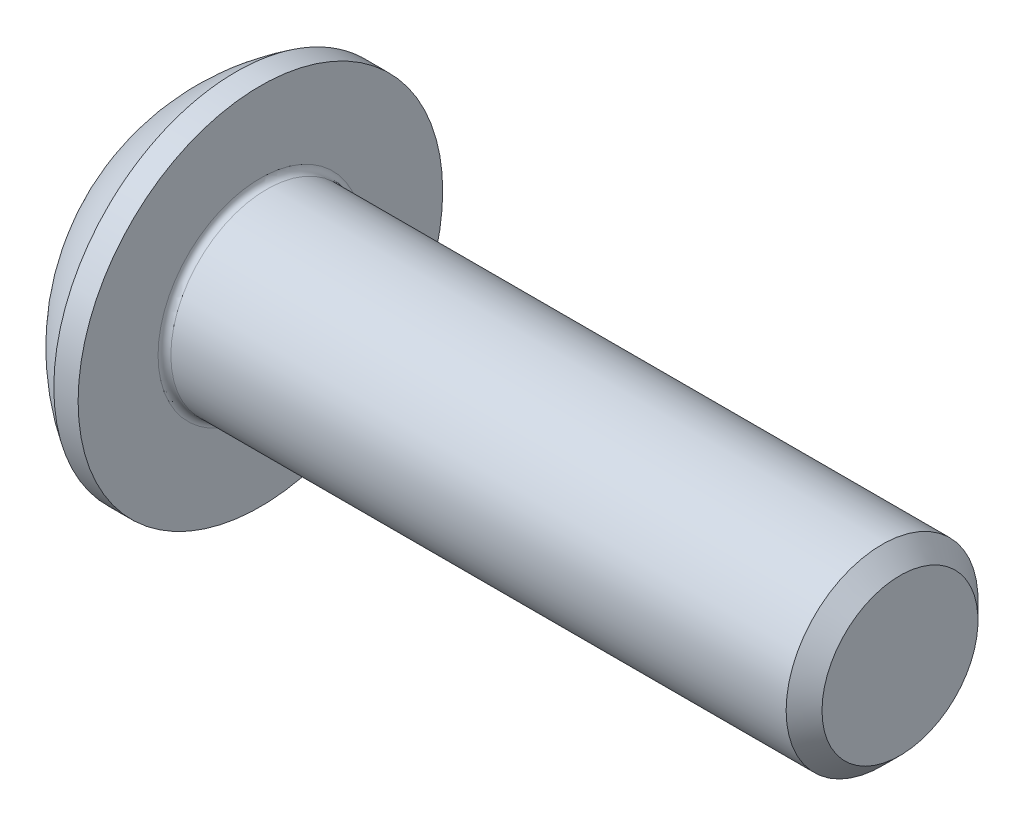
ISO-10303-21;
HEADER;
FILE_DESCRIPTION(('STEP AP214'),'2;1');
FILE_NAME('part.step','',(''),(''),'','','');
FILE_SCHEMA(('AUTOMOTIVE_DESIGN { 1 0 10303 214 1 1 1 1 }'));
ENDSEC;
DATA;
#1=APPLICATION_CONTEXT('core data for automotive mechanical design processes');
#2=APPLICATION_PROTOCOL_DEFINITION('international standard','automotive_design',2000,#1);
#3=PRODUCT_CONTEXT('',#1,'mechanical');
#4=PRODUCT('Part','Part','',(#3));
#5=PRODUCT_RELATED_PRODUCT_CATEGORY('part','',(#4));
#6=PRODUCT_DEFINITION_FORMATION('','',#4);
#7=PRODUCT_DEFINITION_CONTEXT('part definition',#1,'design');
#8=PRODUCT_DEFINITION('design','',#6,#7);
#9=PRODUCT_DEFINITION_SHAPE('','',#8);
#10=(LENGTH_UNIT() NAMED_UNIT(*) SI_UNIT(.MILLI.,.METRE.));
#11=(NAMED_UNIT(*) PLANE_ANGLE_UNIT() SI_UNIT($,.RADIAN.));
#12=(NAMED_UNIT(*) SI_UNIT($,.STERADIAN.) SOLID_ANGLE_UNIT());
#13=UNCERTAINTY_MEASURE_WITH_UNIT(LENGTH_MEASURE(1.E-05),#10,'distance_accuracy_value','');
#14=(GEOMETRIC_REPRESENTATION_CONTEXT(3) GLOBAL_UNCERTAINTY_ASSIGNED_CONTEXT((#13)) GLOBAL_UNIT_ASSIGNED_CONTEXT((#10,
#11,#12)) REPRESENTATION_CONTEXT('',''));
#15=CARTESIAN_POINT('',(0.,0.,0.));
#16=DIRECTION('',(0.,0.,1.));
#17=DIRECTION('',(1.,0.,0.));
#18=AXIS2_PLACEMENT_3D('',#15,#16,#17);
#19=CARTESIAN_POINT('',(1.04000000000026,0.,0.));
#20=DIRECTION('',(-1.,0.,0.));
#21=DIRECTION('',(0.,0.,1.));
#22=AXIS2_PLACEMENT_3D('',#19,#20,#21);
#23=CONICAL_SURFACE('',#22,0.99999999999989,1.04719755119658);
#24=CARTESIAN_POINT('',(1.61735026918985,0.,3.33066907387547E-13));
#25=VERTEX_POINT('',#24);
#26=VERTEX_LOOP('',#25);
#27=FACE_BOUND('',#26,.T.);
#28=CARTESIAN_POINT('',(1.04000000000013,0.,0.));
#29=DIRECTION('',(-1.,0.,0.));
#30=DIRECTION('',(0.,0.,1.));
#31=AXIS2_PLACEMENT_3D('',#28,#29,#30);
#32=CIRCLE('',#31,1.00000000000011);
#33=CARTESIAN_POINT('',(1.04000000000003,-0.866025403784484,0.500000000000028));
#34=VERTEX_POINT('',#33);
#35=CARTESIAN_POINT('',(1.04000000000004,0.,0.999999999999919));
#36=VERTEX_POINT('',#35);
#37=EDGE_CURVE('E97',#34,#36,#32,.T.);
#38=ORIENTED_EDGE('',*,*,#37,.T.);
#39=CARTESIAN_POINT('',(1.04000000000013,0.,0.));
#40=DIRECTION('',(-1.,0.,0.));
#41=DIRECTION('',(0.,0.,1.));
#42=AXIS2_PLACEMENT_3D('',#39,#40,#41);
#43=CIRCLE('',#42,1.00000000000011);
#44=CARTESIAN_POINT('',(1.04000000000003,0.866025403784488,0.500000000000026));
#45=VERTEX_POINT('',#44);
#46=EDGE_CURVE('E158',#36,#45,#43,.T.);
#47=ORIENTED_EDGE('',*,*,#46,.T.);
#48=CARTESIAN_POINT('',(1.04000000000013,0.,0.));
#49=DIRECTION('',(-1.,0.,0.));
#50=DIRECTION('',(0.,0.,1.));
#51=AXIS2_PLACEMENT_3D('',#48,#49,#50);
#52=CIRCLE('',#51,1.00000000000011);
#53=CARTESIAN_POINT('',(1.04000000000003,0.866025403784489,-0.500000000000027));
#54=VERTEX_POINT('',#53);
#55=EDGE_CURVE('E355',#45,#54,#52,.T.);
#56=ORIENTED_EDGE('',*,*,#55,.T.);
#57=CARTESIAN_POINT('',(1.04000000000013,0.,0.));
#58=DIRECTION('',(-1.,0.,0.));
#59=DIRECTION('',(0.,0.,1.));
#60=AXIS2_PLACEMENT_3D('',#57,#58,#59);
#61=CIRCLE('',#60,1.00000000000011);
#62=CARTESIAN_POINT('',(1.04000000000004,0.,-0.999999999999917));
#63=VERTEX_POINT('',#62);
#64=EDGE_CURVE('E356',#54,#63,#61,.T.);
#65=ORIENTED_EDGE('',*,*,#64,.T.);
#66=CARTESIAN_POINT('',(1.04000000000013,0.,0.));
#67=DIRECTION('',(-1.,0.,0.));
#68=DIRECTION('',(0.,0.,1.));
#69=AXIS2_PLACEMENT_3D('',#66,#67,#68);
#70=CIRCLE('',#69,1.00000000000011);
#71=CARTESIAN_POINT('',(1.04000000000003,-0.866025403784487,-0.500000000000027));
#72=VERTEX_POINT('',#71);
#73=EDGE_CURVE('E100',#63,#72,#70,.T.);
#74=ORIENTED_EDGE('',*,*,#73,.T.);
#75=CARTESIAN_POINT('',(1.04000000000013,0.,0.));
#76=DIRECTION('',(-1.,0.,0.));
#77=DIRECTION('',(0.,0.,1.));
#78=AXIS2_PLACEMENT_3D('',#75,#76,#77);
#79=CIRCLE('',#78,1.00000000000011);
#80=EDGE_CURVE('E95',#72,#34,#79,.T.);
#81=ORIENTED_EDGE('',*,*,#80,.T.);
#82=EDGE_LOOP('',(#38,#47,#56,#65,#74,#81));
#83=FACE_BOUND('',#82,.T.);
#84=ADVANCED_FACE('F16',(#27,#83),#23,.F.);
#85=CARTESIAN_POINT('',(1.03999999999993,-1.73205080756887,-1.));
#86=DIRECTION('',(1.,0.,0.));
#87=DIRECTION('',(0.,0.,-1.));
#88=AXIS2_PLACEMENT_3D('',#85,#86,#87);
#89=PLANE('',#88);
#90=DIRECTION('',(0.,0.499999999999999,0.866025403784439));
#91=VECTOR('',#90,1.);
#92=CARTESIAN_POINT('',(1.03999999999993,-1.15470053837925,0.));
#93=LINE('',#92,#91);
#94=CARTESIAN_POINT('',(1.03999999999993,-0.577350269189623,0.999999999999999));
#95=VERTEX_POINT('',#94);
#96=EDGE_CURVE('E109',#95,#34,#93,.F.);
#97=ORIENTED_EDGE('',*,*,#96,.F.);
#98=DIRECTION('',(0.,1.,0.));
#99=VECTOR('',#98,1.);
#100=CARTESIAN_POINT('',(1.03999999999993,-0.577350269189626,1.));
#101=LINE('',#100,#99);
#102=EDGE_CURVE('E111',#36,#95,#101,.F.);
#103=ORIENTED_EDGE('',*,*,#102,.F.);
#104=ORIENTED_EDGE('',*,*,#37,.F.);
#105=EDGE_LOOP('',(#97,#103,#104));
#106=FACE_BOUND('',#105,.T.);
#107=ADVANCED_FACE('F107',(#106),#89,.F.);
#108=CARTESIAN_POINT('',(1.03999999999993,-1.73205080756887,-1.));
#109=DIRECTION('',(1.,0.,0.));
#110=DIRECTION('',(0.,0.,-1.));
#111=AXIS2_PLACEMENT_3D('',#108,#109,#110);
#112=PLANE('',#111);
#113=DIRECTION('',(0.,-0.499999999999997,0.86602540378444));
#114=VECTOR('',#113,1.);
#115=CARTESIAN_POINT('',(1.03999999999993,-0.577350269189626,-1.));
#116=LINE('',#115,#114);
#117=CARTESIAN_POINT('',(1.03999999999993,-1.15470053837925,0.));
#118=VERTEX_POINT('',#117);
#119=EDGE_CURVE('E118',#118,#72,#116,.F.);
#120=ORIENTED_EDGE('',*,*,#119,.F.);
#121=DIRECTION('',(0.,0.499999999999999,0.866025403784439));
#122=VECTOR('',#121,1.);
#123=CARTESIAN_POINT('',(1.03999999999993,-1.15470053837925,0.));
#124=LINE('',#123,#122);
#125=EDGE_CURVE('E115',#34,#118,#124,.F.);
#126=ORIENTED_EDGE('',*,*,#125,.F.);
#127=ORIENTED_EDGE('',*,*,#80,.F.);
#128=EDGE_LOOP('',(#120,#126,#127));
#129=FACE_BOUND('',#128,.T.);
#130=ADVANCED_FACE('F116',(#129),#112,.F.);
#131=CARTESIAN_POINT('',(1.03999999999993,-1.73205080756887,-1.));
#132=DIRECTION('',(1.,0.,0.));
#133=DIRECTION('',(0.,0.,-1.));
#134=AXIS2_PLACEMENT_3D('',#131,#132,#133);
#135=PLANE('',#134);
#136=DIRECTION('',(0.,-1.,0.));
#137=VECTOR('',#136,1.);
#138=CARTESIAN_POINT('',(1.03999999999993,0.577350269189626,-1.));
#139=LINE('',#138,#137);
#140=CARTESIAN_POINT('',(1.03999999999993,-0.577350269189626,-1.));
#141=VERTEX_POINT('',#140);
#142=EDGE_CURVE('E324',#141,#63,#139,.F.);
#143=ORIENTED_EDGE('',*,*,#142,.F.);
#144=DIRECTION('',(0.,-0.499999999999997,0.86602540378444));
#145=VECTOR('',#144,1.);
#146=CARTESIAN_POINT('',(1.03999999999993,-0.577350269189626,-1.));
#147=LINE('',#146,#145);
#148=EDGE_CURVE('E336',#72,#141,#147,.F.);
#149=ORIENTED_EDGE('',*,*,#148,.F.);
#150=ORIENTED_EDGE('',*,*,#73,.F.);
#151=EDGE_LOOP('',(#143,#149,#150));
#152=FACE_BOUND('',#151,.T.);
#153=ADVANCED_FACE('F202',(#152),#135,.F.);
#154=CARTESIAN_POINT('',(1.03999999999993,-1.73205080756887,-1.));
#155=DIRECTION('',(1.,0.,0.));
#156=DIRECTION('',(0.,0.,-1.));
#157=AXIS2_PLACEMENT_3D('',#154,#155,#156);
#158=PLANE('',#157);
#159=DIRECTION('',(0.,-0.499999999999998,-0.86602540378444));
#160=VECTOR('',#159,1.);
#161=CARTESIAN_POINT('',(1.03999999999993,1.15470053837925,0.));
#162=LINE('',#161,#160);
#163=CARTESIAN_POINT('',(1.03999999999993,0.577350269189628,-1.));
#164=VERTEX_POINT('',#163);
#165=EDGE_CURVE('E309',#164,#54,#162,.F.);
#166=ORIENTED_EDGE('',*,*,#165,.F.);
#167=DIRECTION('',(0.,-1.,0.));
#168=VECTOR('',#167,1.);
#169=CARTESIAN_POINT('',(1.03999999999993,0.577350269189626,-1.));
#170=LINE('',#169,#168);
#171=EDGE_CURVE('E321',#63,#164,#170,.F.);
#172=ORIENTED_EDGE('',*,*,#171,.F.);
#173=ORIENTED_EDGE('',*,*,#64,.F.);
#174=EDGE_LOOP('',(#166,#172,#173));
#175=FACE_BOUND('',#174,.T.);
#176=ADVANCED_FACE('F198',(#175),#158,.F.);
#177=CARTESIAN_POINT('',(1.03999999999993,-1.73205080756887,-1.));
#178=DIRECTION('',(1.,0.,0.));
#179=DIRECTION('',(0.,0.,-1.));
#180=AXIS2_PLACEMENT_3D('',#177,#178,#179);
#181=PLANE('',#180);
#182=DIRECTION('',(0.,0.499999999999998,-0.86602540378444));
#183=VECTOR('',#182,1.);
#184=CARTESIAN_POINT('',(1.03999999999993,0.577350269189626,1.));
#185=LINE('',#184,#183);
#186=CARTESIAN_POINT('',(1.03999999999993,1.15470053837925,0.));
#187=VERTEX_POINT('',#186);
#188=EDGE_CURVE('E287',#187,#45,#185,.F.);
#189=ORIENTED_EDGE('',*,*,#188,.F.);
#190=DIRECTION('',(0.,-0.499999999999998,-0.86602540378444));
#191=VECTOR('',#190,1.);
#192=CARTESIAN_POINT('',(1.03999999999993,1.15470053837925,0.));
#193=LINE('',#192,#191);
#194=EDGE_CURVE('E306',#54,#187,#193,.F.);
#195=ORIENTED_EDGE('',*,*,#194,.F.);
#196=ORIENTED_EDGE('',*,*,#55,.F.);
#197=EDGE_LOOP('',(#189,#195,#196));
#198=FACE_BOUND('',#197,.T.);
#199=ADVANCED_FACE('F194',(#198),#181,.F.);
#200=CARTESIAN_POINT('',(1.03999999999993,-1.73205080756887,-1.));
#201=DIRECTION('',(1.,0.,0.));
#202=DIRECTION('',(0.,0.,-1.));
#203=AXIS2_PLACEMENT_3D('',#200,#201,#202);
#204=PLANE('',#203);
#205=DIRECTION('',(0.,1.,0.));
#206=VECTOR('',#205,1.);
#207=CARTESIAN_POINT('',(1.03999999999993,-0.577350269189626,1.));
#208=LINE('',#207,#206);
#209=CARTESIAN_POINT('',(1.03999999999993,0.577350269189626,1.));
#210=VERTEX_POINT('',#209);
#211=EDGE_CURVE('E127',#210,#36,#208,.F.);
#212=ORIENTED_EDGE('',*,*,#211,.F.);
#213=DIRECTION('',(0.,0.499999999999998,-0.86602540378444));
#214=VECTOR('',#213,1.);
#215=CARTESIAN_POINT('',(1.03999999999993,0.577350269189626,1.));
#216=LINE('',#215,#214);
#217=EDGE_CURVE('E290',#45,#210,#216,.F.);
#218=ORIENTED_EDGE('',*,*,#217,.F.);
#219=ORIENTED_EDGE('',*,*,#46,.F.);
#220=EDGE_LOOP('',(#212,#218,#219));
#221=FACE_BOUND('',#220,.T.);
#222=ADVANCED_FACE('F190',(#221),#204,.F.);
#223=CARTESIAN_POINT('',(1.03999999999993,-0.577350269189626,1.));
#224=DIRECTION('',(0.,0.,-1.));
#225=DIRECTION('',(0.,1.,0.));
#226=AXIS2_PLACEMENT_3D('',#223,#224,#225);
#227=PLANE('',#226);
#228=DIRECTION('',(0.,1.,0.));
#229=VECTOR('',#228,1.);
#230=CARTESIAN_POINT('',(0.,0.,1.));
#231=LINE('',#230,#229);
#232=CARTESIAN_POINT('',(0.,0.577350269189626,1.));
#233=VERTEX_POINT('',#232);
#234=CARTESIAN_POINT('',(0.,-0.577350269189625,1.));
#235=VERTEX_POINT('',#234);
#236=EDGE_CURVE('E283',#233,#235,#231,.F.);
#237=ORIENTED_EDGE('',*,*,#236,.F.);
#238=DIRECTION('',(1.,0.,0.));
#239=VECTOR('',#238,1.);
#240=CARTESIAN_POINT('',(1.03999999999993,0.577350269189626,1.));
#241=LINE('',#240,#239);
#242=EDGE_CURVE('E296',#210,#233,#241,.F.);
#243=ORIENTED_EDGE('',*,*,#242,.F.);
#244=ORIENTED_EDGE('',*,*,#211,.T.);
#245=ORIENTED_EDGE('',*,*,#102,.T.);
#246=DIRECTION('',(1.,0.,0.));
#247=VECTOR('',#246,1.);
#248=CARTESIAN_POINT('',(1.03999999999993,-0.577350269189622,0.999999999999999));
#249=LINE('',#248,#247);
#250=EDGE_CURVE('E121',#235,#95,#249,.T.);
#251=ORIENTED_EDGE('',*,*,#250,.F.);
#252=EDGE_LOOP('',(#237,#243,#244,#245,#251));
#253=FACE_BOUND('',#252,.T.);
#254=ADVANCED_FACE('F187',(#253),#227,.T.);
#255=CARTESIAN_POINT('',(1.03999999999993,-1.15470053837925,0.));
#256=DIRECTION('',(0.,0.866025403784439,-0.499999999999999));
#257=DIRECTION('',(0.,0.499999999999999,0.866025403784439));
#258=AXIS2_PLACEMENT_3D('',#255,#256,#257);
#259=PLANE('',#258);
#260=DIRECTION('',(0.,-0.499999999999996,-0.866025403784441));
#261=VECTOR('',#260,1.);
#262=CARTESIAN_POINT('',(0.,-0.577350269189626,1.));
#263=LINE('',#262,#261);
#264=CARTESIAN_POINT('',(0.,-1.15470053837925,0.));
#265=VERTEX_POINT('',#264);
#266=EDGE_CURVE('E280',#235,#265,#263,.T.);
#267=ORIENTED_EDGE('',*,*,#266,.F.);
#268=ORIENTED_EDGE('',*,*,#250,.T.);
#269=ORIENTED_EDGE('',*,*,#96,.T.);
#270=ORIENTED_EDGE('',*,*,#125,.T.);
#271=DIRECTION('',(1.,0.,0.));
#272=VECTOR('',#271,1.);
#273=CARTESIAN_POINT('',(1.03999999999993,-1.15470053837925,0.));
#274=LINE('',#273,#272);
#275=EDGE_CURVE('E333',#265,#118,#274,.T.);
#276=ORIENTED_EDGE('',*,*,#275,.F.);
#277=EDGE_LOOP('',(#267,#268,#269,#270,#276));
#278=FACE_BOUND('',#277,.T.);
#279=ADVANCED_FACE('F125',(#278),#259,.T.);
#280=CARTESIAN_POINT('',(1.03999999999993,-0.577350269189626,-1.));
#281=DIRECTION('',(0.,0.86602540378444,0.499999999999997));
#282=DIRECTION('',(0.,-0.499999999999997,0.86602540378444));
#283=AXIS2_PLACEMENT_3D('',#280,#281,#282);
#284=PLANE('',#283);
#285=DIRECTION('',(0.,0.499999999999996,-0.866025403784441));
#286=VECTOR('',#285,1.);
#287=CARTESIAN_POINT('',(0.,-1.15470053837925,0.));
#288=LINE('',#287,#286);
#289=CARTESIAN_POINT('',(0.,-0.577350269189626,-1.));
#290=VERTEX_POINT('',#289);
#291=EDGE_CURVE('E277',#265,#290,#288,.T.);
#292=ORIENTED_EDGE('',*,*,#291,.F.);
#293=ORIENTED_EDGE('',*,*,#275,.T.);
#294=ORIENTED_EDGE('',*,*,#119,.T.);
#295=ORIENTED_EDGE('',*,*,#148,.T.);
#296=DIRECTION('',(1.,0.,0.));
#297=VECTOR('',#296,1.);
#298=CARTESIAN_POINT('',(1.03999999999993,-0.577350269189626,-1.));
#299=LINE('',#298,#297);
#300=EDGE_CURVE('E318',#290,#141,#299,.T.);
#301=ORIENTED_EDGE('',*,*,#300,.F.);
#302=EDGE_LOOP('',(#292,#293,#294,#295,#301));
#303=FACE_BOUND('',#302,.T.);
#304=ADVANCED_FACE('F180',(#303),#284,.T.);
#305=CARTESIAN_POINT('',(1.03999999999993,0.577350269189626,-1.));
#306=DIRECTION('',(0.,0.,1.));
#307=DIRECTION('',(0.,-1.,0.));
#308=AXIS2_PLACEMENT_3D('',#305,#306,#307);
#309=PLANE('',#308);
#310=DIRECTION('',(0.,1.,0.));
#311=VECTOR('',#310,1.);
#312=CARTESIAN_POINT('',(0.,0.,-1.));
#313=LINE('',#312,#311);
#314=CARTESIAN_POINT('',(0.,0.577350269189627,-1.));
#315=VERTEX_POINT('',#314);
#316=EDGE_CURVE('E274',#290,#315,#313,.T.);
#317=ORIENTED_EDGE('',*,*,#316,.F.);
#318=ORIENTED_EDGE('',*,*,#300,.T.);
#319=ORIENTED_EDGE('',*,*,#142,.T.);
#320=ORIENTED_EDGE('',*,*,#171,.T.);
#321=DIRECTION('',(1.,0.,0.));
#322=VECTOR('',#321,1.);
#323=CARTESIAN_POINT('',(1.03999999999993,0.577350269189628,-1.));
#324=LINE('',#323,#322);
#325=EDGE_CURVE('E291',#315,#164,#324,.T.);
#326=ORIENTED_EDGE('',*,*,#325,.F.);
#327=EDGE_LOOP('',(#317,#318,#319,#320,#326));
#328=FACE_BOUND('',#327,.T.);
#329=ADVANCED_FACE('F176',(#328),#309,.T.);
#330=CARTESIAN_POINT('',(1.03999999999993,1.15470053837925,0.));
#331=DIRECTION('',(0.,-0.86602540378444,0.499999999999998));
#332=DIRECTION('',(0.,-0.499999999999998,-0.86602540378444));
#333=AXIS2_PLACEMENT_3D('',#330,#331,#332);
#334=PLANE('',#333);
#335=DIRECTION('',(0.,0.5,0.866025403784439));
#336=VECTOR('',#335,1.);
#337=CARTESIAN_POINT('',(0.,0.577350269189626,-1.));
#338=LINE('',#337,#336);
#339=CARTESIAN_POINT('',(0.,1.15470053837925,0.));
#340=VERTEX_POINT('',#339);
#341=EDGE_CURVE('E271',#315,#340,#338,.T.);
#342=ORIENTED_EDGE('',*,*,#341,.F.);
#343=ORIENTED_EDGE('',*,*,#325,.T.);
#344=ORIENTED_EDGE('',*,*,#165,.T.);
#345=ORIENTED_EDGE('',*,*,#194,.T.);
#346=DIRECTION('',(1.,0.,0.));
#347=VECTOR('',#346,1.);
#348=CARTESIAN_POINT('',(1.03999999999993,1.15470053837925,0.));
#349=LINE('',#348,#347);
#350=EDGE_CURVE('E286',#340,#187,#349,.T.);
#351=ORIENTED_EDGE('',*,*,#350,.F.);
#352=EDGE_LOOP('',(#342,#343,#344,#345,#351));
#353=FACE_BOUND('',#352,.T.);
#354=ADVANCED_FACE('F172',(#353),#334,.T.);
#355=CARTESIAN_POINT('',(1.03999999999993,0.577350269189626,1.));
#356=DIRECTION('',(0.,-0.86602540378444,-0.499999999999998));
#357=DIRECTION('',(0.,0.499999999999998,-0.86602540378444));
#358=AXIS2_PLACEMENT_3D('',#355,#356,#357);
#359=PLANE('',#358);
#360=DIRECTION('',(0.,-0.5,0.866025403784439));
#361=VECTOR('',#360,1.);
#362=CARTESIAN_POINT('',(0.,1.15470053837925,0.));
#363=LINE('',#362,#361);
#364=EDGE_CURVE('E157',#340,#233,#363,.T.);
#365=ORIENTED_EDGE('',*,*,#364,.F.);
#366=ORIENTED_EDGE('',*,*,#350,.T.);
#367=ORIENTED_EDGE('',*,*,#188,.T.);
#368=ORIENTED_EDGE('',*,*,#217,.T.);
#369=ORIENTED_EDGE('',*,*,#242,.T.);
#370=EDGE_LOOP('',(#365,#366,#367,#368,#369));
#371=FACE_BOUND('',#370,.T.);
#372=ADVANCED_FACE('F168',(#371),#359,.T.);
#373=CARTESIAN_POINT('',(0.,0.,0.));
#374=DIRECTION('',(-1.,0.,0.));
#375=DIRECTION('',(0.,0.,1.));
#376=AXIS2_PLACEMENT_3D('',#373,#374,#375);
#377=PLANE('',#376);
#378=ORIENTED_EDGE('',*,*,#341,.T.);
#379=ORIENTED_EDGE('',*,*,#364,.T.);
#380=ORIENTED_EDGE('',*,*,#236,.T.);
#381=ORIENTED_EDGE('',*,*,#266,.T.);
#382=ORIENTED_EDGE('',*,*,#291,.T.);
#383=ORIENTED_EDGE('',*,*,#316,.T.);
#384=EDGE_LOOP('',(#378,#379,#380,#381,#382,#383));
#385=FACE_BOUND('',#384,.T.);
#386=CARTESIAN_POINT('',(0.,1.42499999999991,0.));
#387=CARTESIAN_POINT('',(1.41401909941221E-13,1.42499547133831,0.0799833360146242));
#388=CARTESIAN_POINT('',(1.14531875076236E-13,1.41822890220758,0.160109019716947));
#389=CARTESIAN_POINT('',(0.,1.39809415024748,0.278523524351196));
#390=CARTESIAN_POINT('',(-1.36863752895278E-13,1.38970085869294,0.317749539599044));
#391=CARTESIAN_POINT('',(1.36975050238227E-13,1.36963357855856,0.395393827236229));
#392=CARTESIAN_POINT('',(4.90613092188047E-13,1.35795692767256,0.433811416830798));
#393=CARTESIAN_POINT('',(8.08502525158743E-13,1.31816256652486,0.547245538496193));
#394=CARTESIAN_POINT('',(0.,1.28524776326101,0.620634351866271));
#395=CARTESIAN_POINT('',(0.,1.20754836567171,0.760838579302516));
#396=CARTESIAN_POINT('',(6.68760632896524E-13,1.16276332012511,0.827653743353454));
#397=CARTESIAN_POINT('',(4.22719058943647E-13,1.08769646787847,0.921494986115497));
#398=CARTESIAN_POINT('',(1.23148001965926E-13,1.06133948212691,0.951729494931847));
#399=CARTESIAN_POINT('',(-1.23029268744086E-13,1.00620185445041,1.00984457256197));
#400=CARTESIAN_POINT('',(0.,0.977423573796173,1.03772738282286));
#401=CARTESIAN_POINT('',(1.39906133813925E-13,0.887686851976161,1.11760418663794));
#402=CARTESIAN_POINT('',(3.47455893346232E-13,0.82331026114331,1.1658468514302));
#403=CARTESIAN_POINT('',(3.20413154846107E-13,0.687406523978964,1.25081092212933));
#404=CARTESIAN_POINT('',(0.,0.615879647408065,1.28753276246904));
#405=CARTESIAN_POINT('',(0.,0.467668101636249,1.34845363271997));
#406=CARTESIAN_POINT('',(0.,0.390983487532261,1.37265279637922));
#407=CARTESIAN_POINT('',(0.,0.234641768263891,1.40783152102352));
#408=CARTESIAN_POINT('',(0.,0.154984647227407,1.41881101140992));
#409=CARTESIAN_POINT('',(0.,-0.00504231192437741,1.42724192135203));
#410=CARTESIAN_POINT('',(0.,-0.0854121500396767,1.42469334090774));
#411=CARTESIAN_POINT('',(0.,-0.244584849637579,1.40613727575172));
#412=CARTESIAN_POINT('',(0.,-0.323387719486129,1.39012986291562));
#413=CARTESIAN_POINT('',(0.,-0.477180160001662,1.34511986433288));
#414=CARTESIAN_POINT('',(0.,-0.552169689930563,1.31611713978921));
#415=CARTESIAN_POINT('',(0.,-0.696248843253794,1.24590377451843));
#416=CARTESIAN_POINT('',(0.,-0.76533824402978,1.20469267341783));
#417=CARTESIAN_POINT('',(0.,-0.862971403767596,1.13468732254868));
#418=CARTESIAN_POINT('',(0.,-0.894520211596358,1.10998280332566));
#419=CARTESIAN_POINT('',(0.,-0.955459158435751,1.05798313994372));
#420=CARTESIAN_POINT('',(0.,-0.98484718477193,1.03068551863096));
#421=CARTESIAN_POINT('',(0.,-1.06935902683452,0.945251569286646));
#422=CARTESIAN_POINT('',(0.,-1.1209168811559,0.883512164450193));
#423=CARTESIAN_POINT('',(0.,-1.2129183767408,0.752248511496138));
#424=CARTESIAN_POINT('',(0.,-1.25336244045669,0.682724559422658));
#425=CARTESIAN_POINT('',(0.,-1.30485581691182,0.574099869234571));
#426=CARTESIAN_POINT('',(0.,-1.32050463064857,0.537121902892333));
#427=CARTESIAN_POINT('',(0.,-1.34861944625481,0.462016055728994));
#428=CARTESIAN_POINT('',(0.,-1.36108802394618,0.423889133669822));
#429=CARTESIAN_POINT('',(1.81511978732957E-13,-1.39355394851478,0.308245859389784));
#430=CARTESIAN_POINT('',(9.8800978305374E-13,-1.40870242218982,0.229274754599015));
#431=CARTESIAN_POINT('',(3.75337112713248E-13,-1.41974083887083,0.124862105658288));
#432=CARTESIAN_POINT('',(1.04888549676474E-13,-1.4217113220651,0.0999338996932106));
#433=CARTESIAN_POINT('',(-1.04888549676541E-13,-1.42434161069688,0.0500084356096711));
#434=CARTESIAN_POINT('',(0.,-1.42500141613439,0.0250111774912094));
#435=CARTESIAN_POINT('',(1.41401981085223E-13,-1.42499547133833,-0.0799833360146248));
#436=CARTESIAN_POINT('',(1.14531823815202E-13,-1.4182289022076,-0.160109019716947));
#437=CARTESIAN_POINT('',(0.,-1.39809415024749,-0.278523524351197));
#438=CARTESIAN_POINT('',(-1.36863657854438E-13,-1.38970085869295,-0.317749539599045));
#439=CARTESIAN_POINT('',(1.369749551201E-13,-1.36963357855858,-0.39539382723623));
#440=CARTESIAN_POINT('',(4.90612737300539E-13,-1.35795692767258,-0.433811416830799));
#441=CARTESIAN_POINT('',(8.08503233242052E-13,-1.31816256652487,-0.547245538496193));
#442=CARTESIAN_POINT('',(0.,-1.28524776326102,-0.62063435186627));
#443=CARTESIAN_POINT('',(0.,-1.20754836567172,-0.760838579302516));
#444=CARTESIAN_POINT('',(6.6874588779984E-13,-1.16276332012513,-0.827653743353455));
#445=CARTESIAN_POINT('',(4.22726441152782E-13,-1.08769646787849,-0.921494986115498));
#446=CARTESIAN_POINT('',(1.23169189925226E-13,-1.06133948212692,-0.951729494931847));
#447=CARTESIAN_POINT('',(-1.23050436275001E-13,-1.00620185445042,-1.00984457256197));
#448=CARTESIAN_POINT('',(0.,-0.977423573796185,-1.03772738282286));
#449=CARTESIAN_POINT('',(1.40060606893405E-13,-0.887686851976174,-1.11760418663794));
#450=CARTESIAN_POINT('',(3.48297917793837E-13,-0.823310261143324,-1.1658468514302));
#451=CARTESIAN_POINT('',(3.21305852918933E-13,-0.687406523978979,-1.25081092212933));
#452=CARTESIAN_POINT('',(0.,-0.615879647408078,-1.28753276246904));
#453=CARTESIAN_POINT('',(0.,-0.467668101636262,-1.34845363271997));
#454=CARTESIAN_POINT('',(0.,-0.390983487532273,-1.37265279637922));
#455=CARTESIAN_POINT('',(0.,-0.234641768263904,-1.40783152102352));
#456=CARTESIAN_POINT('',(0.,-0.154984647227419,-1.41881101140992));
#457=CARTESIAN_POINT('',(0.,0.00504231192436431,-1.42724192135203));
#458=CARTESIAN_POINT('',(0.,0.0854121500396633,-1.42469334090774));
#459=CARTESIAN_POINT('',(0.,0.244584849637566,-1.40613727575172));
#460=CARTESIAN_POINT('',(0.,0.323387719486116,-1.39012986291562));
#461=CARTESIAN_POINT('',(0.,0.477180160001648,-1.34511986433288));
#462=CARTESIAN_POINT('',(0.,0.552169689930549,-1.31611713978921));
#463=CARTESIAN_POINT('',(0.,0.69624884325378,-1.24590377451842));
#464=CARTESIAN_POINT('',(0.,0.765338244029767,-1.20469267341783));
#465=CARTESIAN_POINT('',(0.,0.862971403767583,-1.13468732254867));
#466=CARTESIAN_POINT('',(0.,0.894520211596344,-1.10998280332566));
#467=CARTESIAN_POINT('',(0.,0.955459158435737,-1.05798313994372));
#468=CARTESIAN_POINT('',(0.,0.984847184771917,-1.03068551863097));
#469=CARTESIAN_POINT('',(0.,1.06935902683451,-0.945251569286649));
#470=CARTESIAN_POINT('',(0.,1.12091688115589,-0.883512164450194));
#471=CARTESIAN_POINT('',(0.,1.21291837674078,-0.752248511496137));
#472=CARTESIAN_POINT('',(0.,1.25336244045668,-0.682724559422657));
#473=CARTESIAN_POINT('',(0.,1.30485581691181,-0.574099869234571));
#474=CARTESIAN_POINT('',(0.,1.32050463064856,-0.537121902892333));
#475=CARTESIAN_POINT('',(0.,1.3486194462548,-0.462016055728993));
#476=CARTESIAN_POINT('',(0.,1.36108802394617,-0.423889133669821));
#477=CARTESIAN_POINT('',(1.81517543922135E-13,1.39355394851477,-0.308245859389783));
#478=CARTESIAN_POINT('',(9.8801052315667E-13,1.40870242218981,-0.229274754599014));
#479=CARTESIAN_POINT('',(3.7533688127947E-13,1.41974083887081,-0.124862105658288));
#480=CARTESIAN_POINT('',(1.0488848625626E-13,1.42171132206508,-0.0999338996932104));
#481=CARTESIAN_POINT('',(-1.04888486256328E-13,1.42434161069687,-0.0500084356096714));
#482=CARTESIAN_POINT('',(0.,1.42500141613438,-0.0250111774912099));
#483=CARTESIAN_POINT('',(0.,1.42499999999991,0.));
#484=B_SPLINE_CURVE_WITH_KNOTS('',3,(#386,#387,#388,#389,#390,#391,#392,#393,#394,#395,#396,
#397,#398,#399,#400,#401,#402,#403,#404,#405,#406,#407,#408,#409,#410,#411,#412,#413,#414,#415,
#416,#417,#418,#419,#420,#421,#422,#423,#424,#425,#426,#427,#428,#429,#430,#431,#432,#433,#434,
#435,#436,#437,#438,#439,#440,#441,#442,#443,#444,#445,#446,#447,#448,#449,#450,#451,#452,#453,
#454,#455,#456,#457,#458,#459,#460,#461,#462,#463,#464,#465,#466,#467,#468,#469,#470,#471,#472,
#473,#474,#475,#476,#477,#478,#479,#480,#481,#482,#483),.UNSPECIFIED.,.T.,.F.,(4,2,2,2,2,2,2,2,
2,2,2,2,2,2,2,2,2,2,2,2,2,2,2,2,2,2,2,2,2,2,2,2,2,2,2,2,2,2,2,2,2,2,2,2,2,2,2,2,4),(0.,
0.239833624278644,0.360065645132435,0.480395438436383,0.72048142713597,0.960576543485306,
1.08078140880884,1.20087037853754,1.44097126816492,1.68106310286293,1.92115237321524,
2.16124292574023,2.40133347826517,2.64142274861718,2.88151458331504,3.12161547294237,
3.24170444267091,3.36190930799436,3.60200442434396,3.84209041304366,3.96242020634782,
4.08265222720191,4.32248585148035,4.3974829901855,4.4724801288907,4.71231375316934,
4.83254577402313,4.95287556732708,5.19296155602667,5.433056672376,5.55326153769954,
5.67335050742823,5.91345139705561,6.15354323175363,6.39363250210594,6.63372305463093,
6.87381360715586,7.11390287750788,7.35399471220574,7.59409560183307,7.71418457156161,
7.83438943688506,8.07448455323465,8.31457054193436,8.43490033523852,8.5551323560926,
8.79496598037104,8.86996311907619,8.94496025778139),.UNSPECIFIED.);
#485=CARTESIAN_POINT('',(0.,1.42499999999991,0.));
#486=VERTEX_POINT('',#485);
#487=EDGE_CURVE('E150',#486,#486,#484,.T.);
#488=ORIENTED_EDGE('',*,*,#487,.F.);
#489=EDGE_LOOP('',(#488));
#490=FACE_BOUND('',#489,.T.);
#491=ADVANCED_FACE('F164',(#385,#490),#377,.T.);
#492=CARTESIAN_POINT('',(3.03337598425202,0.,0.));
#493=DIRECTION('',(0.,1.,0.));
#494=DIRECTION('',(1.,0.,0.));
#495=AXIS2_PLACEMENT_3D('',#492,#493,#494);
#496=SPHERICAL_SURFACE('',#495,3.35141684393879);
#497=CARTESIAN_POINT('',(1.2700000000001,0.,0.));
#498=DIRECTION('',(-1.,0.,0.));
#499=DIRECTION('',(0.,0.,1.));
#500=AXIS2_PLACEMENT_3D('',#497,#498,#499);
#501=CIRCLE('',#500,2.85);
#502=CARTESIAN_POINT('',(1.2700000000001,0.,2.85));
#503=VERTEX_POINT('',#502);
#504=EDGE_CURVE('E147',#503,#503,#501,.F.);
#505=ORIENTED_EDGE('',*,*,#504,.F.);
#506=EDGE_LOOP('',(#505));
#507=FACE_BOUND('',#506,.T.);
#508=ORIENTED_EDGE('',*,*,#487,.T.);
#509=EDGE_LOOP('',(#508));
#510=FACE_BOUND('',#509,.T.);
#511=ADVANCED_FACE('F160',(#507,#510),#496,.T.);
#512=CARTESIAN_POINT('',(0.,0.,0.));
#513=DIRECTION('',(-1.,0.,0.));
#514=DIRECTION('',(0.,0.,1.));
#515=AXIS2_PLACEMENT_3D('',#512,#513,#514);
#516=CYLINDRICAL_SURFACE('',#515,2.85);
#517=ORIENTED_EDGE('',*,*,#504,.T.);
#518=EDGE_LOOP('',(#517));
#519=FACE_BOUND('',#518,.T.);
#520=CARTESIAN_POINT('',(1.64999999999993,0.,0.));
#521=DIRECTION('',(-1.,0.,0.));
#522=DIRECTION('',(0.,0.,1.));
#523=AXIS2_PLACEMENT_3D('',#520,#521,#522);
#524=CIRCLE('',#523,2.85);
#525=CARTESIAN_POINT('',(1.64999999999993,0.,2.85));
#526=VERTEX_POINT('',#525);
#527=EDGE_CURVE('E144',#526,#526,#524,.T.);
#528=ORIENTED_EDGE('',*,*,#527,.T.);
#529=EDGE_LOOP('',(#528));
#530=FACE_BOUND('',#529,.T.);
#531=ADVANCED_FACE('F369',(#519,#530),#516,.T.);
#532=CARTESIAN_POINT('',(11.6499999999999,0.,0.));
#533=DIRECTION('',(-1.,0.,0.));
#534=DIRECTION('',(0.,0.,1.));
#535=AXIS2_PLACEMENT_3D('',#532,#533,#534);
#536=PLANE('',#535);
#537=CARTESIAN_POINT('',(11.6499999999746,0.,0.));
#538=DIRECTION('',(-1.,0.,0.));
#539=DIRECTION('',(0.,0.,1.));
#540=AXIS2_PLACEMENT_3D('',#537,#538,#539);
#541=CIRCLE('',#540,1.21950000004745);
#542=CARTESIAN_POINT('',(11.6499999999746,0.,1.21950000004745));
#543=VERTEX_POINT('',#542);
#544=EDGE_CURVE('E140',#543,#543,#541,.T.);
#545=ORIENTED_EDGE('',*,*,#544,.F.);
#546=EDGE_LOOP('',(#545));
#547=FACE_BOUND('',#546,.T.);
#548=ADVANCED_FACE('F247',(#547),#536,.F.);
#549=CARTESIAN_POINT('',(1.64999999999993,1.49999999999999,0.));
#550=DIRECTION('',(-1.,0.,0.));
#551=DIRECTION('',(0.,0.,1.));
#552=AXIS2_PLACEMENT_3D('',#549,#550,#551);
#553=PLANE('',#552);
#554=ORIENTED_EDGE('',*,*,#527,.F.);
#555=EDGE_LOOP('',(#554));
#556=FACE_BOUND('',#555,.T.);
#557=CARTESIAN_POINT('',(1.64999999999992,0.,0.));
#558=DIRECTION('',(1.,0.,0.));
#559=DIRECTION('',(0.,0.,1.));
#560=AXIS2_PLACEMENT_3D('',#557,#558,#559);
#561=CIRCLE('',#560,1.6);
#562=CARTESIAN_POINT('',(1.64999999999992,0.,-1.6));
#563=VERTEX_POINT('',#562);
#564=CARTESIAN_POINT('',(1.64999999999992,0.,1.6));
#565=VERTEX_POINT('',#564);
#566=EDGE_CURVE('E143',#563,#565,#561,.F.);
#567=ORIENTED_EDGE('',*,*,#566,.T.);
#568=CARTESIAN_POINT('',(1.64999999999992,0.,0.));
#569=DIRECTION('',(1.,0.,0.));
#570=DIRECTION('',(0.,0.,-1.));
#571=AXIS2_PLACEMENT_3D('',#568,#569,#570);
#572=CIRCLE('',#571,1.6);
#573=EDGE_CURVE('E35',#565,#563,#572,.F.);
#574=ORIENTED_EDGE('',*,*,#573,.T.);
#575=EDGE_LOOP('',(#567,#574));
#576=FACE_BOUND('',#575,.T.);
#577=ADVANCED_FACE('F238',(#556,#576),#553,.F.);
#578=CARTESIAN_POINT('',(11.3695000001144,0.,0.));
#579=DIRECTION('',(-1.,0.,0.));
#580=DIRECTION('',(0.,0.,1.));
#581=AXIS2_PLACEMENT_3D('',#578,#579,#580);
#582=CONICAL_SURFACE('',#581,1.49999999990769,0.785398163397448);
#583=CARTESIAN_POINT('',(11.3695,0.,0.));
#584=DIRECTION('',(-1.,0.,0.));
#585=DIRECTION('',(0.,0.,1.));
#586=AXIS2_PLACEMENT_3D('',#583,#584,#585);
#587=CIRCLE('',#586,1.5);
#588=CARTESIAN_POINT('',(11.3695,0.,1.5));
#589=VERTEX_POINT('',#588);
#590=EDGE_CURVE('E27',#589,#589,#587,.T.);
#591=ORIENTED_EDGE('',*,*,#590,.F.);
#592=EDGE_LOOP('',(#591));
#593=FACE_BOUND('',#592,.T.);
#594=ORIENTED_EDGE('',*,*,#544,.T.);
#595=EDGE_LOOP('',(#594));
#596=FACE_BOUND('',#595,.T.);
#597=ADVANCED_FACE('F222',(#593,#596),#582,.T.);
#598=CARTESIAN_POINT('',(1.74999999999992,0.,0.));
#599=DIRECTION('',(-1.,0.,0.));
#600=DIRECTION('',(0.,0.,1.));
#601=AXIS2_PLACEMENT_3D('',#598,#599,#600);
#602=TOROIDAL_SURFACE('',#601,1.6,0.1);
#603=ORIENTED_EDGE('',*,*,#573,.F.);
#604=ORIENTED_EDGE('',*,*,#566,.F.);
#605=EDGE_LOOP('',(#603,#604));
#606=FACE_BOUND('',#605,.T.);
#607=CARTESIAN_POINT('',(1.74999999999992,0.,0.));
#608=DIRECTION('',(-1.,0.,0.));
#609=DIRECTION('',(0.,0.,1.));
#610=AXIS2_PLACEMENT_3D('',#607,#608,#609);
#611=CIRCLE('',#610,1.5);
#612=CARTESIAN_POINT('',(1.74999999999992,0.,1.5));
#613=VERTEX_POINT('',#612);
#614=EDGE_CURVE('E11',#613,#613,#611,.F.);
#615=ORIENTED_EDGE('',*,*,#614,.F.);
#616=EDGE_LOOP('',(#615));
#617=FACE_BOUND('',#616,.T.);
#618=ADVANCED_FACE('F216',(#606,#617),#602,.F.);
#619=CARTESIAN_POINT('',(0.,0.,0.));
#620=DIRECTION('',(-1.,0.,0.));
#621=DIRECTION('',(0.,0.,1.));
#622=AXIS2_PLACEMENT_3D('',#619,#620,#621);
#623=CYLINDRICAL_SURFACE('',#622,1.5);
#624=ORIENTED_EDGE('',*,*,#614,.T.);
#625=EDGE_LOOP('',(#624));
#626=FACE_BOUND('',#625,.T.);
#627=ORIENTED_EDGE('',*,*,#590,.T.);
#628=EDGE_LOOP('',(#627));
#629=FACE_BOUND('',#628,.T.);
#630=ADVANCED_FACE('F214',(#626,#629),#623,.T.);
#631=CLOSED_SHELL('',(#84,#107,#130,#153,#176,#199,#222,#254,#279,#304,#329,#354,#372,#491,#511,
#531,#548,#577,#597,#618,#630));
#632=MANIFOLD_SOLID_BREP('B1',#631);
#633=ADVANCED_BREP_SHAPE_REPRESENTATION('',(#18,#632),#14);
#634=SHAPE_DEFINITION_REPRESENTATION(#9,#633);
ENDSEC;
END-ISO-10303-21;
